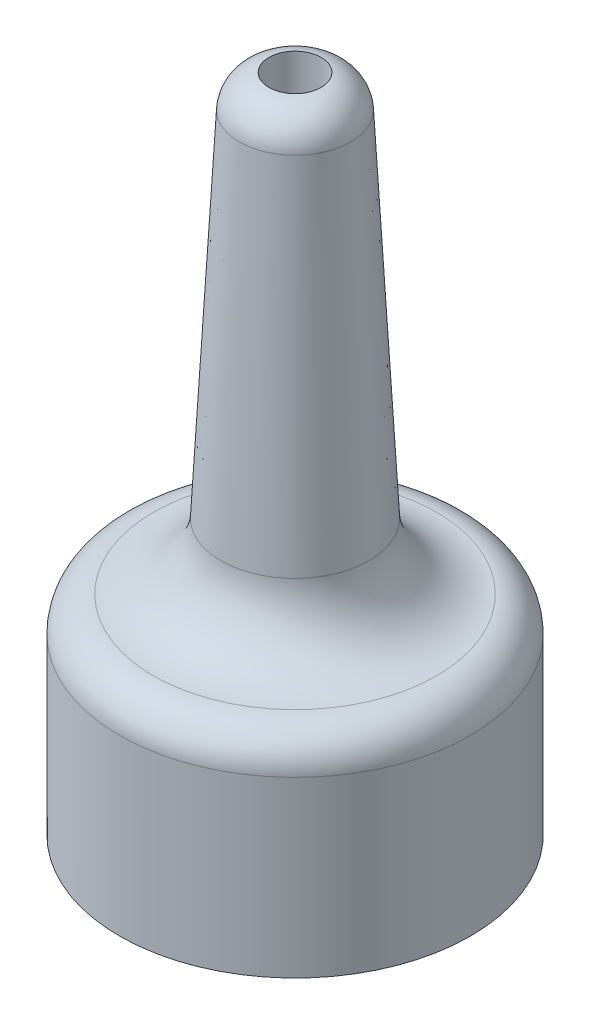
ISO-10303-21;
HEADER;
FILE_DESCRIPTION(('STEP AP214'),'2;1');
FILE_NAME('part.step','',(''),(''),'','','');
FILE_SCHEMA(('AUTOMOTIVE_DESIGN { 1 0 10303 214 1 1 1 1 }'));
ENDSEC;
DATA;
#1=APPLICATION_CONTEXT('core data for automotive mechanical design processes');
#2=APPLICATION_PROTOCOL_DEFINITION('international standard','automotive_design',2000,#1);
#3=PRODUCT_CONTEXT('',#1,'mechanical');
#4=PRODUCT('Part','Part','',(#3));
#5=PRODUCT_RELATED_PRODUCT_CATEGORY('part','',(#4));
#6=PRODUCT_DEFINITION_FORMATION('','',#4);
#7=PRODUCT_DEFINITION_CONTEXT('part definition',#1,'design');
#8=PRODUCT_DEFINITION('design','',#6,#7);
#9=PRODUCT_DEFINITION_SHAPE('','',#8);
#10=(LENGTH_UNIT() NAMED_UNIT(*) SI_UNIT(.MILLI.,.METRE.));
#11=(NAMED_UNIT(*) PLANE_ANGLE_UNIT() SI_UNIT($,.RADIAN.));
#12=(NAMED_UNIT(*) SI_UNIT($,.STERADIAN.) SOLID_ANGLE_UNIT());
#13=UNCERTAINTY_MEASURE_WITH_UNIT(LENGTH_MEASURE(1.E-05),#10,'distance_accuracy_value','');
#14=(GEOMETRIC_REPRESENTATION_CONTEXT(3) GLOBAL_UNCERTAINTY_ASSIGNED_CONTEXT((#13)) GLOBAL_UNIT_ASSIGNED_CONTEXT((#10,
#11,#12)) REPRESENTATION_CONTEXT('',''));
#15=CARTESIAN_POINT('',(0.,0.,0.));
#16=DIRECTION('',(0.,0.,1.));
#17=DIRECTION('',(1.,0.,0.));
#18=AXIS2_PLACEMENT_3D('',#15,#16,#17);
#19=CARTESIAN_POINT('',(0.,2.00000000000001,0.));
#20=DIRECTION('',(0.,-1.,0.));
#21=DIRECTION('',(1.,0.,0.));
#22=AXIS2_PLACEMENT_3D('',#19,#20,#21);
#23=TOROIDAL_SURFACE('',#22,4.12829656458798,2.);
#24=CARTESIAN_POINT('',(0.,0.000681266254318712,0.));
#25=DIRECTION('',(0.,1.,0.));
#26=DIRECTION('',(-1.,0.,0.));
#27=AXIS2_PLACEMENT_3D('',#24,#25,#26);
#28=CIRCLE('',#27,4.07609885486262);
#29=CARTESIAN_POINT('',(-4.07609885486262,0.00068126625430473,0.));
#30=VERTEX_POINT('',#29);
#31=EDGE_CURVE('E45',#30,#30,#28,.T.);
#32=ORIENTED_EDGE('',*,*,#31,.T.);
#33=EDGE_LOOP('',(#32));
#34=FACE_BOUND('',#33,.T.);
#35=CARTESIAN_POINT('',(0.,1.89532808751412,0.));
#36=DIRECTION('',(0.,-1.,0.));
#37=DIRECTION('',(1.,0.,0.));
#38=AXIS2_PLACEMENT_3D('',#35,#36,#37);
#39=CIRCLE('',#38,2.13103749507884);
#40=CARTESIAN_POINT('',(2.13103749507883,1.89532808751413,0.));
#41=VERTEX_POINT('',#40);
#42=EDGE_CURVE('E55',#41,#41,#39,.F.);
#43=ORIENTED_EDGE('',*,*,#42,.F.);
#44=EDGE_LOOP('',(#43));
#45=FACE_BOUND('',#44,.T.);
#46=ADVANCED_FACE('F37',(#34,#45),#23,.F.);
#47=CARTESIAN_POINT('',(0.,12.9821839518094,0.));
#48=DIRECTION('',(0.,-1.,0.));
#49=DIRECTION('',(1.,0.,0.));
#50=AXIS2_PLACEMENT_3D('',#47,#48,#49);
#51=CONICAL_SURFACE('',#50,1.54999999999995,0.0523598775598303);
#52=CARTESIAN_POINT('',(0.,12.0637252091241,0.));
#53=DIRECTION('',(0.,1.,0.));
#54=DIRECTION('',(-1.,0.,0.));
#55=AXIS2_PLACEMENT_3D('',#52,#53,#54);
#56=CIRCLE('',#55,1.59813438306718);
#57=CARTESIAN_POINT('',(-1.59813438306722,12.0637252091241,0.));
#58=VERTEX_POINT('',#57);
#59=EDGE_CURVE('E10',#58,#58,#56,.F.);
#60=ORIENTED_EDGE('',*,*,#59,.T.);
#61=EDGE_LOOP('',(#60));
#62=FACE_BOUND('',#61,.T.);
#63=ORIENTED_EDGE('',*,*,#42,.T.);
#64=EDGE_LOOP('',(#63));
#65=FACE_BOUND('',#64,.T.);
#66=ADVANCED_FACE('F111',(#62,#65),#51,.T.);
#67=CARTESIAN_POINT('',(3.43024899888577E-12,-1000.,0.));
#68=DIRECTION('',(0.,-1.,0.));
#69=DIRECTION('',(1.,0.,0.));
#70=AXIS2_PLACEMENT_3D('',#67,#68,#69);
#71=CYLINDRICAL_SURFACE('',#70,5.05000000000001);
#72=CARTESIAN_POINT('',(0.,-0.998978100615888,0.));
#73=DIRECTION('',(0.,1.,0.));
#74=DIRECTION('',(-1.,0.,0.));
#75=AXIS2_PLACEMENT_3D('',#72,#73,#74);
#76=CIRCLE('',#75,5.05000000000001);
#77=CARTESIAN_POINT('',(-5.05000000000001,-0.998978100615906,0.));
#78=VERTEX_POINT('',#77);
#79=EDGE_CURVE('E50',#78,#78,#76,.F.);
#80=ORIENTED_EDGE('',*,*,#79,.T.);
#81=EDGE_LOOP('',(#80));
#82=FACE_BOUND('',#81,.T.);
#83=CARTESIAN_POINT('',(0.,-6.00000000000001,0.));
#84=DIRECTION('',(0.,-1.,0.));
#85=DIRECTION('',(1.,0.,0.));
#86=AXIS2_PLACEMENT_3D('',#83,#84,#85);
#87=CIRCLE('',#86,5.05000000000002);
#88=CARTESIAN_POINT('',(5.05000000000004,-5.99999999999999,0.));
#89=VERTEX_POINT('',#88);
#90=EDGE_CURVE('E61',#89,#89,#87,.T.);
#91=ORIENTED_EDGE('',*,*,#90,.F.);
#92=EDGE_LOOP('',(#91));
#93=FACE_BOUND('',#92,.T.);
#94=ADVANCED_FACE('F106',(#82,#93),#71,.T.);
#95=CARTESIAN_POINT('',(-5.05,-6.,0.));
#96=DIRECTION('',(0.,1.,0.));
#97=DIRECTION('',(-1.,0.,0.));
#98=AXIS2_PLACEMENT_3D('',#95,#96,#97);
#99=PLANE('',#98);
#100=CARTESIAN_POINT('',(0.,-6.00000000000001,0.));
#101=DIRECTION('',(0.,-1.,0.));
#102=DIRECTION('',(1.,0.,0.));
#103=AXIS2_PLACEMENT_3D('',#100,#101,#102);
#104=CIRCLE('',#103,3.95000000000002);
#105=CARTESIAN_POINT('',(3.95000000000004,-5.99999999999999,0.));
#106=VERTEX_POINT('',#105);
#107=EDGE_CURVE('E65',#106,#106,#104,.T.);
#108=ORIENTED_EDGE('',*,*,#107,.F.);
#109=EDGE_LOOP('',(#108));
#110=FACE_BOUND('',#109,.T.);
#111=ORIENTED_EDGE('',*,*,#90,.T.);
#112=EDGE_LOOP('',(#111));
#113=FACE_BOUND('',#112,.T.);
#114=ADVANCED_FACE('F100',(#110,#113),#99,.F.);
#115=CARTESIAN_POINT('',(3.43024899888577E-12,-1000.,0.));
#116=DIRECTION('',(0.,-1.,0.));
#117=DIRECTION('',(1.,0.,0.));
#118=AXIS2_PLACEMENT_3D('',#115,#116,#117);
#119=CYLINDRICAL_SURFACE('',#118,3.95000000000001);
#120=CARTESIAN_POINT('',(0.,-1.,0.));
#121=DIRECTION('',(0.,-1.,0.));
#122=DIRECTION('',(1.,0.,0.));
#123=AXIS2_PLACEMENT_3D('',#120,#121,#122);
#124=CIRCLE('',#123,3.95);
#125=CARTESIAN_POINT('',(3.95000000000001,-0.999999999999987,0.));
#126=VERTEX_POINT('',#125);
#127=EDGE_CURVE('E69',#126,#126,#124,.T.);
#128=ORIENTED_EDGE('',*,*,#127,.F.);
#129=EDGE_LOOP('',(#128));
#130=FACE_BOUND('',#129,.T.);
#131=ORIENTED_EDGE('',*,*,#107,.T.);
#132=EDGE_LOOP('',(#131));
#133=FACE_BOUND('',#132,.T.);
#134=ADVANCED_FACE('F94',(#130,#133),#119,.F.);
#135=CARTESIAN_POINT('',(-3.95,-1.00000000000001,0.));
#136=DIRECTION('',(0.,1.,0.));
#137=DIRECTION('',(-1.,0.,0.));
#138=AXIS2_PLACEMENT_3D('',#135,#136,#137);
#139=PLANE('',#138);
#140=CARTESIAN_POINT('',(0.,-1.,0.));
#141=DIRECTION('',(0.,-1.,0.));
#142=DIRECTION('',(1.,0.,0.));
#143=AXIS2_PLACEMENT_3D('',#140,#141,#142);
#144=CIRCLE('',#143,0.750000000000004);
#145=CARTESIAN_POINT('',(0.750000000000007,-0.999999999999998,0.));
#146=VERTEX_POINT('',#145);
#147=EDGE_CURVE('E73',#146,#146,#144,.T.);
#148=ORIENTED_EDGE('',*,*,#147,.F.);
#149=EDGE_LOOP('',(#148));
#150=FACE_BOUND('',#149,.T.);
#151=ORIENTED_EDGE('',*,*,#127,.T.);
#152=EDGE_LOOP('',(#151));
#153=FACE_BOUND('',#152,.T.);
#154=ADVANCED_FACE('F88',(#150,#153),#139,.F.);
#155=CARTESIAN_POINT('',(3.43024899888577E-12,-1000.,0.));
#156=DIRECTION('',(0.,-1.,0.));
#157=DIRECTION('',(1.,0.,0.));
#158=AXIS2_PLACEMENT_3D('',#155,#156,#157);
#159=CYLINDRICAL_SURFACE('',#158,0.74999999999998);
#160=CARTESIAN_POINT('',(0.,12.9999999999999,0.));
#161=DIRECTION('',(0.,-1.,0.));
#162=DIRECTION('',(1.,0.,0.));
#163=AXIS2_PLACEMENT_3D('',#160,#161,#162);
#164=CIRCLE('',#163,0.749999999999956);
#165=CARTESIAN_POINT('',(0.749999999999911,12.9999999999999,0.));
#166=VERTEX_POINT('',#165);
#167=EDGE_CURVE('E77',#166,#166,#164,.T.);
#168=ORIENTED_EDGE('',*,*,#167,.F.);
#169=EDGE_LOOP('',(#168));
#170=FACE_BOUND('',#169,.T.);
#171=ORIENTED_EDGE('',*,*,#147,.T.);
#172=EDGE_LOOP('',(#171));
#173=FACE_BOUND('',#172,.T.);
#174=ADVANCED_FACE('F84',(#170,#173),#159,.F.);
#175=CARTESIAN_POINT('',(0.,-0.998978100615888,0.));
#176=DIRECTION('',(0.,1.,0.));
#177=DIRECTION('',(-1.,0.,0.));
#178=AXIS2_PLACEMENT_3D('',#175,#176,#177);
#179=TOROIDAL_SURFACE('',#178,4.05000000000001,1.);
#180=ORIENTED_EDGE('',*,*,#31,.F.);
#181=EDGE_LOOP('',(#180));
#182=FACE_BOUND('',#181,.T.);
#183=ORIENTED_EDGE('',*,*,#79,.F.);
#184=EDGE_LOOP('',(#183));
#185=FACE_BOUND('',#184,.T.);
#186=ADVANCED_FACE('F87',(#182,#185),#179,.T.);
#187=CARTESIAN_POINT('',(0.,12.0113892528812,0.));
#188=DIRECTION('',(0.,1.,0.));
#189=DIRECTION('',(-1.,0.,0.));
#190=AXIS2_PLACEMENT_3D('',#187,#188,#189);
#191=DEGENERATE_TOROIDAL_SURFACE('',#190,0.599504848312609,1.,.T.);
#192=ORIENTED_EDGE('',*,*,#167,.T.);
#193=EDGE_LOOP('',(#192));
#194=FACE_BOUND('',#193,.T.);
#195=ORIENTED_EDGE('',*,*,#59,.F.);
#196=EDGE_LOOP('',(#195));
#197=FACE_BOUND('',#196,.T.);
#198=ADVANCED_FACE('F39',(#194,#197),#191,.T.);
#199=CLOSED_SHELL('',(#46,#66,#94,#114,#134,#154,#174,#186,#198));
#200=MANIFOLD_SOLID_BREP('B2',#199);
#201=ADVANCED_BREP_SHAPE_REPRESENTATION('',(#18,#200),#14);
#202=SHAPE_DEFINITION_REPRESENTATION(#9,#201);
ENDSEC;
END-ISO-10303-21;
